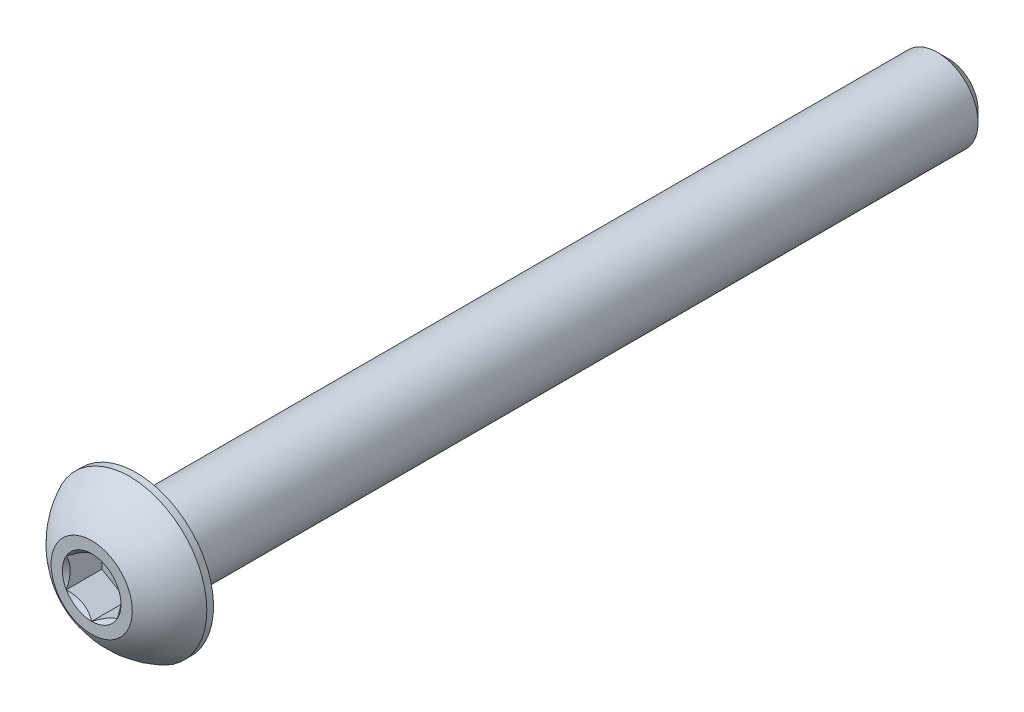
ISO-10303-21;
HEADER;
FILE_DESCRIPTION(('STEP AP214'),'2;1');
FILE_NAME('part.step','',(''),(''),'','','');
FILE_SCHEMA(('AUTOMOTIVE_DESIGN { 1 0 10303 214 1 1 1 1 }'));
ENDSEC;
DATA;
#1=APPLICATION_CONTEXT('core data for automotive mechanical design processes');
#2=APPLICATION_PROTOCOL_DEFINITION('international standard','automotive_design',2000,#1);
#3=PRODUCT_CONTEXT('',#1,'mechanical');
#4=PRODUCT('Part','Part','',(#3));
#5=PRODUCT_RELATED_PRODUCT_CATEGORY('part','',(#4));
#6=PRODUCT_DEFINITION_FORMATION('','',#4);
#7=PRODUCT_DEFINITION_CONTEXT('part definition',#1,'design');
#8=PRODUCT_DEFINITION('design','',#6,#7);
#9=PRODUCT_DEFINITION_SHAPE('','',#8);
#10=(LENGTH_UNIT() NAMED_UNIT(*) SI_UNIT(.MILLI.,.METRE.));
#11=(NAMED_UNIT(*) PLANE_ANGLE_UNIT() SI_UNIT($,.RADIAN.));
#12=(NAMED_UNIT(*) SI_UNIT($,.STERADIAN.) SOLID_ANGLE_UNIT());
#13=UNCERTAINTY_MEASURE_WITH_UNIT(LENGTH_MEASURE(1.E-05),#10,'distance_accuracy_value','');
#14=(GEOMETRIC_REPRESENTATION_CONTEXT(3) GLOBAL_UNCERTAINTY_ASSIGNED_CONTEXT((#13)) GLOBAL_UNIT_ASSIGNED_CONTEXT((#10,
#11,#12)) REPRESENTATION_CONTEXT('',''));
#15=CARTESIAN_POINT('',(0.,0.,0.));
#16=DIRECTION('',(0.,0.,1.));
#17=DIRECTION('',(1.,0.,0.));
#18=AXIS2_PLACEMENT_3D('',#15,#16,#17);
#19=CARTESIAN_POINT('',(0.,0.,21.1));
#20=DIRECTION('',(0.,0.,-1.));
#21=DIRECTION('',(0.,1.,0.));
#22=AXIS2_PLACEMENT_3D('',#19,#20,#21);
#23=PLANE('',#22);
#24=CARTESIAN_POINT('',(0.,0.,21.1));
#25=DIRECTION('',(0.,0.,1.));
#26=DIRECTION('',(1.,0.,0.));
#27=AXIS2_PLACEMENT_3D('',#24,#25,#26);
#28=CIRCLE('',#27,1.44337567297406);
#29=CARTESIAN_POINT('',(0.,1.44337567297406,21.1));
#30=VERTEX_POINT('',#29);
#31=CARTESIAN_POINT('',(-1.25,0.721687836487033,21.1));
#32=VERTEX_POINT('',#31);
#33=EDGE_CURVE('E218',#30,#32,#28,.T.);
#34=ORIENTED_EDGE('',*,*,#33,.F.);
#35=CARTESIAN_POINT('',(1.25,0.721687836487032,21.1));
#36=VERTEX_POINT('',#35);
#37=EDGE_CURVE('E220',#36,#30,#28,.T.);
#38=ORIENTED_EDGE('',*,*,#37,.F.);
#39=CARTESIAN_POINT('',(1.25,-0.721687836487032,21.1));
#40=VERTEX_POINT('',#39);
#41=EDGE_CURVE('E58',#40,#36,#28,.T.);
#42=ORIENTED_EDGE('',*,*,#41,.F.);
#43=CARTESIAN_POINT('',(0.,-1.44337567297406,21.1));
#44=VERTEX_POINT('',#43);
#45=EDGE_CURVE('E65',#44,#40,#28,.T.);
#46=ORIENTED_EDGE('',*,*,#45,.F.);
#47=CARTESIAN_POINT('',(-1.25,-0.721687836487033,21.1));
#48=VERTEX_POINT('',#47);
#49=EDGE_CURVE('E225',#48,#44,#28,.T.);
#50=ORIENTED_EDGE('',*,*,#49,.F.);
#51=EDGE_CURVE('E222',#32,#48,#28,.T.);
#52=ORIENTED_EDGE('',*,*,#51,.F.);
#53=EDGE_LOOP('',(#34,#38,#42,#46,#50,#52));
#54=FACE_BOUND('',#53,.T.);
#55=CARTESIAN_POINT('',(0.,0.,21.1));
#56=DIRECTION('',(0.,0.,1.));
#57=DIRECTION('',(0.,-1.,0.));
#58=AXIS2_PLACEMENT_3D('',#55,#56,#57);
#59=CIRCLE('',#58,1.99999999999999);
#60=CARTESIAN_POINT('',(0.,2.,21.1));
#61=VERTEX_POINT('',#60);
#62=EDGE_CURVE('E52',#61,#61,#59,.T.);
#63=ORIENTED_EDGE('',*,*,#62,.T.);
#64=EDGE_LOOP('',(#63));
#65=FACE_BOUND('',#64,.T.);
#66=ADVANCED_FACE('F39',(#54,#65),#23,.F.);
#67=CARTESIAN_POINT('',(0.,0.,17.3735561497326));
#68=DIRECTION('',(0.,0.,1.));
#69=DIRECTION('',(0.,1.,0.));
#70=AXIS2_PLACEMENT_3D('',#67,#68,#69);
#71=SPHERICAL_SURFACE('',#70,4.22922968981298);
#72=CARTESIAN_POINT('',(0.,0.,19.23));
#73=DIRECTION('',(0.,0.,1.));
#74=DIRECTION('',(0.,-1.,0.));
#75=AXIS2_PLACEMENT_3D('',#72,#73,#74);
#76=CIRCLE('',#75,3.8);
#77=CARTESIAN_POINT('',(0.,3.8,19.23));
#78=VERTEX_POINT('',#77);
#79=EDGE_CURVE('E164',#78,#78,#76,.T.);
#80=CARTESIAN_POINT('',(0.,2.,21.1));
#81=CARTESIAN_POINT('',(0.,2.02421343985614,21.0870045740355));
#82=CARTESIAN_POINT('',(0.,2.04830018323974,21.0737730870349));
#83=CARTESIAN_POINT('',(0.,2.09621120342126,21.0468431584942));
#84=CARTESIAN_POINT('',(0.,2.12003548021917,21.0331447169543));
#85=CARTESIAN_POINT('',(0.,2.16741249358867,21.005286046868));
#86=CARTESIAN_POINT('',(0.,2.19096523016026,20.9911258183216));
#87=CARTESIAN_POINT('',(0.,2.23779021933683,20.962348964764));
#88=CARTESIAN_POINT('',(0.,2.26106247194181,20.9477323397528));
#89=CARTESIAN_POINT('',(0.,2.30731764886072,20.9180482444859));
#90=CARTESIAN_POINT('',(0.,2.33030057317465,20.9029807742302));
#91=CARTESIAN_POINT('',(0.,2.37596836104235,20.8724007144171));
#92=CARTESIAN_POINT('',(0.,2.39865322459612,20.8568881248597));
#93=CARTESIAN_POINT('',(0.,2.44371627121513,20.8254237206041));
#94=CARTESIAN_POINT('',(0.,2.46609445428038,20.8094719059059));
#95=CARTESIAN_POINT('',(0.,2.51053563686181,20.7771351126683));
#96=CARTESIAN_POINT('',(0.,2.53259863637801,20.7607501341289));
#97=CARTESIAN_POINT('',(0.,2.57640106852492,20.7275532390328));
#98=CARTESIAN_POINT('',(0.,2.59814050115564,20.7107413224761));
#99=CARTESIAN_POINT('',(0.,2.64128753915154,20.6766969394119));
#100=CARTESIAN_POINT('',(0.,2.66269514451671,20.6594644729043));
#101=CARTESIAN_POINT('',(0.,2.70517039368395,20.624585537797));
#102=CARTESIAN_POINT('',(0.,2.72623803748602,20.6069390691974));
#103=CARTESIAN_POINT('',(0.,2.76802535840619,20.5712388350756));
#104=CARTESIAN_POINT('',(0.,2.78874503552428,20.5531850695534));
#105=CARTESIAN_POINT('',(0.,2.82982855017313,20.5166771015172));
#106=CARTESIAN_POINT('',(0.,2.85019238770389,20.4982228990032));
#107=CARTESIAN_POINT('',(0.,2.89055648548394,20.460921069069));
#108=CARTESIAN_POINT('',(0.,2.91055674573324,20.4420734416488));
#109=CARTESIAN_POINT('',(0.,2.95018608940553,20.4039919234787));
#110=CARTESIAN_POINT('',(0.,2.96981517282852,20.3847580327288));
#111=CARTESIAN_POINT('',(0.,3.00869470434027,20.3459112962447));
#112=CARTESIAN_POINT('',(0.,3.02794515242903,20.3262984505106));
#113=CARTESIAN_POINT('',(0.,3.06606009863533,20.2867012563963));
#114=CARTESIAN_POINT('',(0.,3.08492459675287,20.2667169080161));
#115=CARTESIAN_POINT('',(0.,3.12226047503003,20.2263843021083));
#116=CARTESIAN_POINT('',(0.,3.14073185518965,20.2060360445808));
#117=CARTESIAN_POINT('',(0.,3.17727447893821,20.1649833521526));
#118=CARTESIAN_POINT('',(0.,3.19534572252716,20.1442789172519));
#119=CARTESIAN_POINT('',(0.,3.23108120656242,20.102521737189));
#120=CARTESIAN_POINT('',(0.,3.24874544700875,20.0814689920269));
#121=CARTESIAN_POINT('',(0.,3.28366021283673,20.039023190901));
#122=CARTESIAN_POINT('',(0.,3.30091073821839,20.0176301349374));
#123=CARTESIAN_POINT('',(0.,3.33499151919534,19.9745118409772));
#124=CARTESIAN_POINT('',(0.,3.35182177479064,19.9527866029806));
#125=CARTESIAN_POINT('',(0.,3.38505562116371,19.9090121999432));
#126=CARTESIAN_POINT('',(0.,3.40145921194149,19.8869630349023));
#127=CARTESIAN_POINT('',(0.,3.43383349577047,19.8425491558485));
#128=CARTESIAN_POINT('',(0.,3.44980418882166,19.8201844418356));
#129=CARTESIAN_POINT('',(0.,3.48130660877275,19.7751479628077));
#130=CARTESIAN_POINT('',(0.,3.49683833567264,19.7524761977926));
#131=CARTESIAN_POINT('',(0.,3.52745692170931,19.7068342314103));
#132=CARTESIAN_POINT('',(0.,3.5425437808461,19.6838640300431));
#133=CARTESIAN_POINT('',(0.,3.57226689871518,19.6376339189693));
#134=CARTESIAN_POINT('',(0.,3.58690315744748,19.6143740092629));
#135=CARTESIAN_POINT('',(0.,3.615719513332,19.5675733197334));
#136=CARTESIAN_POINT('',(0.,3.62989961048422,19.5440325399103));
#137=CARTESIAN_POINT('',(0.,3.65779825442823,19.4966790546141));
#138=CARTESIAN_POINT('',(0.,3.67151680122002,19.4728663491409));
#139=CARTESIAN_POINT('',(0.,3.69848713452321,19.4249780621223));
#140=CARTESIAN_POINT('',(0.,3.71173892103462,19.4009024805769));
#141=CARTESIAN_POINT('',(0.,3.73777068821038,19.3524975842079));
#142=CARTESIAN_POINT('',(0.,3.75055066887474,19.3281682693842));
#143=CARTESIAN_POINT('',(0.,3.77563400658954,19.2792651705548));
#144=CARTESIAN_POINT('',(0.,3.78793736363997,19.254691386549));
#145=CARTESIAN_POINT('',(0.,3.8,19.23));
#146=B_SPLINE_CURVE_WITH_KNOTS('',3,(#80,#81,#82,#83,#84,#85,#86,#87,#88,#89,#90,#91,#92,#93,
#94,#95,#96,#97,#98,#99,#100,#101,#102,#103,#104,#105,#106,#107,#108,#109,#110,#111,#112,#113,
#114,#115,#116,#117,#118,#119,#120,#121,#122,#123,#124,#125,#126,#127,#128,#129,#130,#131,#132,
#133,#134,#135,#136,#137,#138,#139,#140,#141,#142,#143,#144,#145),.UNSPECIFIED.,.F.,.F.,(4,2,2,
2,2,2,2,2,2,2,2,2,2,2,2,2,2,2,2,2,2,2,2,2,2,2,2,2,2,2,2,2,4),(0.,0.0824398589102654,
0.164879717820529,0.247319576730793,0.329759435641059,0.412199294551322,0.494639153461587,
0.577079012371852,0.659518871282116,0.741958730192379,0.824398589102644,0.906838448012908,
0.989278306923173,1.07171816583344,1.1541580247437,1.23659788365396,1.31903774256423,
1.40147760147449,1.48391746038476,1.56635731929502,1.64879717820529,1.73123703711555,
1.81367689602582,1.89611675493608,1.97855661384634,2.06099647275661,2.14343633166687,
2.22587619057714,2.3083160494874,2.39075590839767,2.47319576730793,2.55563562621819,
2.63807548512846),.UNSPECIFIED.);
#147=EDGE_CURVE('BSEAM170',#61,#78,#146,.T.);
#148=ORIENTED_EDGE('',*,*,#62,.F.);
#149=ORIENTED_EDGE('',*,*,#79,.T.);
#150=ORIENTED_EDGE('',*,*,#147,.T.);
#151=ORIENTED_EDGE('',*,*,#147,.F.);
#152=EDGE_LOOP('',(#148,#150,#149,#151));
#153=FACE_BOUND('',#152,.T.);
#154=ADVANCED_FACE('F170',(#153),#71,.T.);
#155=CARTESIAN_POINT('',(0.,0.,21.1));
#156=DIRECTION('',(0.,0.,1.));
#157=DIRECTION('',(0.,-1.,0.));
#158=AXIS2_PLACEMENT_3D('',#155,#156,#157);
#159=CYLINDRICAL_SURFACE('',#158,3.8);
#160=ORIENTED_EDGE('',*,*,#79,.F.);
#161=EDGE_LOOP('',(#160));
#162=FACE_BOUND('',#161,.T.);
#163=CARTESIAN_POINT('',(0.,0.,18.9));
#164=DIRECTION('',(0.,0.,1.));
#165=DIRECTION('',(0.,-1.,0.));
#166=AXIS2_PLACEMENT_3D('',#163,#164,#165);
#167=CIRCLE('',#166,3.8);
#168=CARTESIAN_POINT('',(0.,-3.79999999999999,18.9));
#169=VERTEX_POINT('',#168);
#170=EDGE_CURVE('E161',#169,#169,#167,.T.);
#171=ORIENTED_EDGE('',*,*,#170,.T.);
#172=EDGE_LOOP('',(#171));
#173=FACE_BOUND('',#172,.T.);
#174=ADVANCED_FACE('F173',(#162,#173),#159,.T.);
#175=CARTESIAN_POINT('',(0.,1.99999999999999,18.9));
#176=DIRECTION('',(0.,0.,1.));
#177=DIRECTION('',(0.,-1.,0.));
#178=AXIS2_PLACEMENT_3D('',#175,#176,#177);
#179=PLANE('',#178);
#180=ORIENTED_EDGE('',*,*,#170,.F.);
#181=EDGE_LOOP('',(#180));
#182=FACE_BOUND('',#181,.T.);
#183=CARTESIAN_POINT('',(0.,0.,18.9));
#184=DIRECTION('',(0.,0.,1.));
#185=DIRECTION('',(0.,-1.,0.));
#186=AXIS2_PLACEMENT_3D('',#183,#184,#185);
#187=CIRCLE('',#186,1.99999999999999);
#188=CARTESIAN_POINT('',(0.,-1.99999999999998,18.9));
#189=VERTEX_POINT('',#188);
#190=EDGE_CURVE('E158',#189,#189,#187,.T.);
#191=ORIENTED_EDGE('',*,*,#190,.T.);
#192=EDGE_LOOP('',(#191));
#193=FACE_BOUND('',#192,.T.);
#194=ADVANCED_FACE('F178',(#182,#193),#179,.F.);
#195=CARTESIAN_POINT('',(0.,0.,21.1));
#196=DIRECTION('',(0.,0.,1.));
#197=DIRECTION('',(0.,-1.,0.));
#198=AXIS2_PLACEMENT_3D('',#195,#196,#197);
#199=CYLINDRICAL_SURFACE('',#198,1.99999999999999);
#200=ORIENTED_EDGE('',*,*,#190,.F.);
#201=EDGE_LOOP('',(#200));
#202=FACE_BOUND('',#201,.T.);
#203=CARTESIAN_POINT('',(0.,0.,-20.54));
#204=DIRECTION('',(0.,0.,1.));
#205=DIRECTION('',(0.,-1.,0.));
#206=AXIS2_PLACEMENT_3D('',#203,#204,#205);
#207=CIRCLE('',#206,1.99999999999999);
#208=CARTESIAN_POINT('',(0.,-1.99999999999999,-20.54));
#209=VERTEX_POINT('',#208);
#210=EDGE_CURVE('E155',#209,#209,#207,.T.);
#211=ORIENTED_EDGE('',*,*,#210,.T.);
#212=EDGE_LOOP('',(#211));
#213=FACE_BOUND('',#212,.T.);
#214=ADVANCED_FACE('F184',(#202,#213),#199,.T.);
#215=CARTESIAN_POINT('',(0.,0.,-21.1));
#216=DIRECTION('',(0.,0.,1.));
#217=DIRECTION('',(0.,-1.,0.));
#218=AXIS2_PLACEMENT_3D('',#215,#216,#217);
#219=CONICAL_SURFACE('',#218,1.44,0.785398163397441);
#220=ORIENTED_EDGE('',*,*,#210,.F.);
#221=EDGE_LOOP('',(#220));
#222=FACE_BOUND('',#221,.T.);
#223=CARTESIAN_POINT('',(0.,0.,-21.1));
#224=DIRECTION('',(0.,0.,1.));
#225=DIRECTION('',(0.,-1.,0.));
#226=AXIS2_PLACEMENT_3D('',#223,#224,#225);
#227=CIRCLE('',#226,1.44);
#228=CARTESIAN_POINT('',(0.,-1.43999999999999,-21.1));
#229=VERTEX_POINT('',#228);
#230=EDGE_CURVE('E142',#229,#229,#227,.T.);
#231=ORIENTED_EDGE('',*,*,#230,.T.);
#232=EDGE_LOOP('',(#231));
#233=FACE_BOUND('',#232,.T.);
#234=ADVANCED_FACE('F190',(#222,#233),#219,.T.);
#235=CARTESIAN_POINT('',(0.,0.,-21.1));
#236=DIRECTION('',(0.,0.,1.));
#237=DIRECTION('',(0.,-1.,0.));
#238=AXIS2_PLACEMENT_3D('',#235,#236,#237);
#239=PLANE('',#238);
#240=ORIENTED_EDGE('',*,*,#230,.F.);
#241=EDGE_LOOP('',(#240));
#242=FACE_BOUND('',#241,.T.);
#243=ADVANCED_FACE('F196',(#242),#239,.F.);
#244=CARTESIAN_POINT('',(0.,0.,21.1));
#245=DIRECTION('',(0.,0.,1.));
#246=DIRECTION('',(1.,0.,0.));
#247=AXIS2_PLACEMENT_3D('',#244,#245,#246);
#248=CONICAL_SURFACE('',#247,1.44337567297406,0.78539816339745);
#249=ORIENTED_EDGE('',*,*,#33,.T.);
#250=CARTESIAN_POINT('',(0.000200000000000288,1.4434911430279,21.1001154839091));
#251=CARTESIAN_POINT('',(-0.0427751670715862,1.41867941875065,21.0753216680551));
#252=CARTESIAN_POINT('',(-0.0864690047459469,1.39345276980743,21.0519837344187));
#253=CARTESIAN_POINT('',(-0.17556593084194,1.34201263554194,21.0092520040845));
#254=CARTESIAN_POINT('',(-0.220977498357061,1.31579425481277,20.9898819923604));
#255=CARTESIAN_POINT('',(-0.312547820935257,1.26292610442246,20.9567004834135));
#256=CARTESIAN_POINT('',(-0.358683240175883,1.23628980770471,20.9428055590527));
#257=CARTESIAN_POINT('',(-0.451970080407589,1.18243062538509,20.9213972821606));
#258=CARTESIAN_POINT('',(-0.499118649136376,1.15520938653762,20.9138679415668));
#259=CARTESIAN_POINT('',(-0.580373556887248,1.10829684367467,20.9070744980507));
#260=CARTESIAN_POINT('',(-0.614374876627936,1.08866617256958,20.9060685591044));
#261=CARTESIAN_POINT('',(-0.682317764432473,1.04943932800611,20.9077614149113));
#262=CARTESIAN_POINT('',(-0.716259317655653,1.029843163116,20.9104610272155));
#263=CARTESIAN_POINT('',(-0.783814856457495,0.990839954603502,20.9194089303164));
#264=CARTESIAN_POINT('',(-0.81742850728677,0.971433104248774,20.9256605258997));
#265=CARTESIAN_POINT('',(-0.884094638217808,0.932943395609908,20.9413756814139));
#266=CARTESIAN_POINT('',(-0.917146871030291,0.913860680098303,20.9508406200875));
#267=CARTESIAN_POINT('',(-1.00179969160026,0.86498635135457,20.9789313906876));
#268=CARTESIAN_POINT('',(-1.05286649242964,0.835502920149078,20.9996701574522));
#269=CARTESIAN_POINT('',(-1.15300085411325,0.77769031947591,21.0463871346715));
#270=CARTESIAN_POINT('',(-1.20207431157827,0.749357745598417,21.0723482959468));
#271=CARTESIAN_POINT('',(-1.2502,0.721572366433195,21.1001154839091));
#272=B_SPLINE_CURVE_WITH_KNOTS('',3,(#250,#251,#252,#253,#254,#255,#256,#257,#258,#259,#260,
#261,#262,#263,#264,#265,#266,#267,#268,#269,#270,#271),.UNSPECIFIED.,.F.,.F.,(4,2,2,2,2,2,2,2,
2,2,4),(0.,0.166533409618302,0.334037607289759,0.498880396489694,0.66330791924027,
0.780963963458822,0.898645970148448,1.01643764860773,1.13427993171549,1.32148652032141,
1.50809158792574),.UNSPECIFIED.);
#273=EDGE_CURVE('E11',#30,#32,#272,.T.);
#274=ORIENTED_EDGE('',*,*,#273,.F.);
#275=EDGE_LOOP('',(#249,#274));
#276=FACE_BOUND('',#275,.T.);
#277=ADVANCED_FACE('F201',(#276),#248,.F.);
#278=ORIENTED_EDGE('',*,*,#51,.T.);
#279=CARTESIAN_POINT('',(-1.25,-1.43934010808077,21.5629820968923));
#280=CARTESIAN_POINT('',(-1.25,-1.40429313005658,21.5365249226329));
#281=CARTESIAN_POINT('',(-1.25,-1.36905087135599,21.5103271603543));
#282=CARTESIAN_POINT('',(-1.25,-1.29809650706311,21.4585575718396));
#283=CARTESIAN_POINT('',(-1.25,-1.26238428576495,21.4329859043563));
#284=CARTESIAN_POINT('',(-1.25,-1.15390111792708,21.3570059936895));
#285=CARTESIAN_POINT('',(-1.25,-1.08031646726264,21.3077402861896));
#286=CARTESIAN_POINT('',(-1.25,-0.926012322755094,21.2110258302631));
#287=CARTESIAN_POINT('',(-1.25,-0.845125318656145,21.1638412989418));
#288=CARTESIAN_POINT('',(-1.25,-0.679311174076601,21.0775307343904));
#289=CARTESIAN_POINT('',(-1.25,-0.594398891026687,21.0383775346269));
#290=CARTESIAN_POINT('',(-1.25,-0.466944812460739,20.9904772236883));
#291=CARTESIAN_POINT('',(-1.25,-0.42628998581282,20.9767294897863));
#292=CARTESIAN_POINT('',(-1.25,-0.343998850091266,20.9524979274505));
#293=CARTESIAN_POINT('',(-1.25,-0.302362473614961,20.9420143238698));
#294=CARTESIAN_POINT('',(-1.25,-0.219052696285664,20.9250301617483));
#295=CARTESIAN_POINT('',(-1.25,-0.177393428474499,20.9184613604714));
#296=CARTESIAN_POINT('',(-1.25,-0.0936293693401909,20.9094350534578));
#297=CARTESIAN_POINT('',(-1.25,-0.0515246558543948,20.9069768409973));
#298=CARTESIAN_POINT('',(-1.25,0.0311890576306328,20.9063540620133));
#299=CARTESIAN_POINT('',(-1.25,0.0717969625499318,20.9080371168462));
#300=CARTESIAN_POINT('',(-1.25,0.152668636885199,20.9152682705979));
#301=CARTESIAN_POINT('',(-1.25,0.19293233883536,20.9208171104131));
#302=CARTESIAN_POINT('',(-1.25,0.273499879165297,20.935571036465));
#303=CARTESIAN_POINT('',(-1.25,0.313792180618513,20.9448381759641));
#304=CARTESIAN_POINT('',(-1.25,0.393496413911459,20.9665361784573));
#305=CARTESIAN_POINT('',(-1.25,0.432908419115061,20.9789667767306));
#306=CARTESIAN_POINT('',(-1.25,0.5569927358623,21.0227793529314));
#307=CARTESIAN_POINT('',(-1.25,0.639898924666088,21.059151072876));
#308=CARTESIAN_POINT('',(-1.25,0.801816555499705,21.1400191621783));
#309=CARTESIAN_POINT('',(-1.25,0.880812666325048,21.184544720912));
#310=CARTESIAN_POINT('',(-1.25,1.0317856127975,21.2764048766666));
#311=CARTESIAN_POINT('',(-1.25,1.10391618485086,21.3234899339162));
#312=CARTESIAN_POINT('',(-1.25,1.21018606043311,21.3962785615985));
#313=CARTESIAN_POINT('',(-1.25,1.2451506996938,21.4207980853934));
#314=CARTESIAN_POINT('',(-1.25,1.31460220852737,21.4704856367657));
#315=CARTESIAN_POINT('',(-1.25,1.34908920596618,21.4956534854155));
#316=CARTESIAN_POINT('',(-1.25,1.38337731682912,21.5210901488412));
#317=B_SPLINE_CURVE_WITH_KNOTS('',3,(#279,#280,#281,#282,#283,#284,#285,#286,#287,#288,#289,
#290,#291,#292,#293,#294,#295,#296,#297,#298,#299,#300,#301,#302,#303,#304,#305,#306,#307,#308,
#309,#310,#311,#312,#313,#314,#315,#316),.UNSPECIFIED.,.F.,.F.,(4,2,2,2,2,2,2,2,2,2,2,2,2,2,2,2,
2,2,4),(0.,0.131732960381448,0.263498984161645,0.529042014455824,0.809741926134618,
1.08947609717225,1.21811634272577,1.346765447839,1.47310084517844,1.59941451973784,
1.72115042167849,1.84290966131735,1.96679153905342,2.09066305366039,2.36146692896009,
2.63325989198491,2.89154668212279,3.01965734507713,3.14773302245628),.UNSPECIFIED.);
#318=EDGE_CURVE('E224',#32,#48,#317,.F.);
#319=ORIENTED_EDGE('',*,*,#318,.F.);
#320=EDGE_LOOP('',(#278,#319));
#321=FACE_BOUND('',#320,.T.);
#322=ADVANCED_FACE('F207',(#321),#248,.F.);
#323=ORIENTED_EDGE('',*,*,#49,.T.);
#324=CARTESIAN_POINT('',(-1.2502,-0.721572366433194,21.1001154839091));
#325=CARTESIAN_POINT('',(-1.20722483292841,-0.746384090710444,21.0753216680551));
#326=CARTESIAN_POINT('',(-1.16353099525405,-0.771610739653664,21.0519837344187));
#327=CARTESIAN_POINT('',(-1.07443406915806,-0.823050873919153,21.0092520040845));
#328=CARTESIAN_POINT('',(-1.02902250164294,-0.849269254648332,20.9898819923604));
#329=CARTESIAN_POINT('',(-0.937452179064742,-0.902137405038634,20.9567004834135));
#330=CARTESIAN_POINT('',(-0.891316759824117,-0.928773701756386,20.9428055590527));
#331=CARTESIAN_POINT('',(-0.79802991959241,-0.982632884076011,20.9213972821606));
#332=CARTESIAN_POINT('',(-0.750881350863623,-1.00985412292348,20.9138679415668));
#333=CARTESIAN_POINT('',(-0.66962644311275,-1.05676666578643,20.9070744980507));
#334=CARTESIAN_POINT('',(-0.635625123372062,-1.07639733689152,20.9060685591044));
#335=CARTESIAN_POINT('',(-0.567682235567525,-1.11562418145499,20.9077614149113));
#336=CARTESIAN_POINT('',(-0.533740682344345,-1.1352203463451,20.9104610272155));
#337=CARTESIAN_POINT('',(-0.466185143542503,-1.1742235548576,20.9194089303164));
#338=CARTESIAN_POINT('',(-0.432571492713228,-1.19363040521232,20.9256605258997));
#339=CARTESIAN_POINT('',(-0.36590536178219,-1.23212011385119,20.9413756814139));
#340=CARTESIAN_POINT('',(-0.332853128969707,-1.25120282936279,20.9508406200875));
#341=CARTESIAN_POINT('',(-0.248200308399738,-1.30007715810653,20.9789313906876));
#342=CARTESIAN_POINT('',(-0.197133507570364,-1.32956058931202,20.9996701574522));
#343=CARTESIAN_POINT('',(-0.0969991458867463,-1.38737318998519,21.0463871346715));
#344=CARTESIAN_POINT('',(-0.0479256884217311,-1.41570576386268,21.0723482959468));
#345=CARTESIAN_POINT('',(0.000200000000000502,-1.4434911430279,21.1001154839091));
#346=B_SPLINE_CURVE_WITH_KNOTS('',3,(#324,#325,#326,#327,#328,#329,#330,#331,#332,#333,#334,
#335,#336,#337,#338,#339,#340,#341,#342,#343,#344,#345),.UNSPECIFIED.,.F.,.F.,(4,2,2,2,2,2,2,2,
2,2,4),(0.,0.166533409618302,0.33403760728976,0.498880396489696,0.663307919240272,
0.780963963458824,0.89864597014845,1.01643764860773,1.13427993171549,1.32148652032141,
1.50809158792574),.UNSPECIFIED.);
#347=EDGE_CURVE('E234',#48,#44,#346,.T.);
#348=ORIENTED_EDGE('',*,*,#347,.F.);
#349=EDGE_LOOP('',(#323,#348));
#350=FACE_BOUND('',#349,.T.);
#351=ADVANCED_FACE('F284',(#350),#248,.F.);
#352=ORIENTED_EDGE('',*,*,#45,.T.);
#353=CARTESIAN_POINT('',(-0.000200000000000873,-1.4434911430279,21.1001154839091));
#354=CARTESIAN_POINT('',(0.0427751670715854,-1.41867941875065,21.0753216680551));
#355=CARTESIAN_POINT('',(0.0864690047459462,-1.39345276980743,21.0519837344187));
#356=CARTESIAN_POINT('',(0.175565930841939,-1.34201263554194,21.0092520040845));
#357=CARTESIAN_POINT('',(0.220977498357061,-1.31579425481276,20.9898819923604));
#358=CARTESIAN_POINT('',(0.312547820935256,-1.26292610442246,20.9567004834135));
#359=CARTESIAN_POINT('',(0.358683240175882,-1.23628980770471,20.9428055590527));
#360=CARTESIAN_POINT('',(0.451970080407588,-1.18243062538509,20.9213972821606));
#361=CARTESIAN_POINT('',(0.499118649136376,-1.15520938653761,20.9138679415668));
#362=CARTESIAN_POINT('',(0.580373556887249,-1.10829684367467,20.9070744980507));
#363=CARTESIAN_POINT('',(0.614374876627938,-1.08866617256958,20.9060685591043));
#364=CARTESIAN_POINT('',(0.682317764432474,-1.04943932800611,20.9077614149113));
#365=CARTESIAN_POINT('',(0.716259317655654,-1.02984316311599,20.9104610272155));
#366=CARTESIAN_POINT('',(0.783814856457496,-0.990839954603501,20.9194089303164));
#367=CARTESIAN_POINT('',(0.817428507286771,-0.971433104248773,20.9256605258997));
#368=CARTESIAN_POINT('',(0.88409463821781,-0.932943395609907,20.9413756814139));
#369=CARTESIAN_POINT('',(0.917146871030292,-0.913860680098302,20.9508406200875));
#370=CARTESIAN_POINT('',(1.00179969160026,-0.864986351354569,20.9789313906876));
#371=CARTESIAN_POINT('',(1.05286649242964,-0.835502920149077,20.9996701574522));
#372=CARTESIAN_POINT('',(1.15300085411325,-0.777690319475909,21.0463871346715));
#373=CARTESIAN_POINT('',(1.20207431157827,-0.749357745598416,21.0723482959468));
#374=CARTESIAN_POINT('',(1.2502,-0.721572366433194,21.1001154839091));
#375=B_SPLINE_CURVE_WITH_KNOTS('',3,(#353,#354,#355,#356,#357,#358,#359,#360,#361,#362,#363,
#364,#365,#366,#367,#368,#369,#370,#371,#372,#373,#374),.UNSPECIFIED.,.F.,.F.,(4,2,2,2,2,2,2,2,
2,2,4),(0.,0.166533409618302,0.33403760728976,0.498880396489695,0.663307919240272,
0.780963963458824,0.898645970148451,1.01643764860773,1.13427993171549,1.32148652032141,
1.50809158792574),.UNSPECIFIED.);
#376=EDGE_CURVE('E272',#44,#40,#375,.T.);
#377=ORIENTED_EDGE('',*,*,#376,.F.);
#378=EDGE_LOOP('',(#352,#377));
#379=FACE_BOUND('',#378,.T.);
#380=ADVANCED_FACE('F285',(#379),#248,.F.);
#381=ORIENTED_EDGE('',*,*,#41,.T.);
#382=CARTESIAN_POINT('',(1.25,-1.43934010808077,21.5629820968923));
#383=CARTESIAN_POINT('',(1.25,-1.40429313005658,21.5365249226329));
#384=CARTESIAN_POINT('',(1.25,-1.36905087135599,21.5103271603543));
#385=CARTESIAN_POINT('',(1.25,-1.29809650706311,21.4585575718396));
#386=CARTESIAN_POINT('',(1.25,-1.26238428576495,21.4329859043563));
#387=CARTESIAN_POINT('',(1.25,-1.15390111792708,21.3570059936895));
#388=CARTESIAN_POINT('',(1.25,-1.08031646726264,21.3077402861896));
#389=CARTESIAN_POINT('',(1.25,-0.926012322755094,21.2110258302631));
#390=CARTESIAN_POINT('',(1.25,-0.845125318656146,21.1638412989418));
#391=CARTESIAN_POINT('',(1.25,-0.679311174076601,21.0775307343904));
#392=CARTESIAN_POINT('',(1.25,-0.594398891026686,21.0383775346269));
#393=CARTESIAN_POINT('',(1.25,-0.466944812460738,20.9904772236883));
#394=CARTESIAN_POINT('',(1.25,-0.426289985812819,20.9767294897863));
#395=CARTESIAN_POINT('',(1.25,-0.343998850091265,20.9524979274505));
#396=CARTESIAN_POINT('',(1.25,-0.302362473614961,20.9420143238698));
#397=CARTESIAN_POINT('',(1.25,-0.219052696285664,20.9250301617483));
#398=CARTESIAN_POINT('',(1.25,-0.177393428474498,20.9184613604714));
#399=CARTESIAN_POINT('',(1.25,-0.0936293693401907,20.9094350534578));
#400=CARTESIAN_POINT('',(1.25,-0.0515246558543946,20.9069768409973));
#401=CARTESIAN_POINT('',(1.25,0.0311890576306331,20.9063540620133));
#402=CARTESIAN_POINT('',(1.25,0.0717969625499321,20.9080371168462));
#403=CARTESIAN_POINT('',(1.25,0.152668636885199,20.9152682705979));
#404=CARTESIAN_POINT('',(1.25,0.19293233883536,20.9208171104131));
#405=CARTESIAN_POINT('',(1.25,0.273499879165297,20.935571036465));
#406=CARTESIAN_POINT('',(1.25,0.313792180618513,20.9448381759641));
#407=CARTESIAN_POINT('',(1.25,0.393496413911459,20.9665361784573));
#408=CARTESIAN_POINT('',(1.25,0.432908419115061,20.9789667767306));
#409=CARTESIAN_POINT('',(1.25,0.5569927358623,21.0227793529314));
#410=CARTESIAN_POINT('',(1.25,0.639898924666088,21.059151072876));
#411=CARTESIAN_POINT('',(1.25,0.801816555499704,21.1400191621783));
#412=CARTESIAN_POINT('',(1.25,0.880812666325047,21.184544720912));
#413=CARTESIAN_POINT('',(1.25,1.0317856127975,21.2764048766666));
#414=CARTESIAN_POINT('',(1.25,1.10391618485086,21.3234899339162));
#415=CARTESIAN_POINT('',(1.25,1.21018606043311,21.3962785615985));
#416=CARTESIAN_POINT('',(1.25,1.2451506996938,21.4207980853934));
#417=CARTESIAN_POINT('',(1.25,1.31460220852737,21.4704856367657));
#418=CARTESIAN_POINT('',(1.25,1.34908920596618,21.4956534854155));
#419=CARTESIAN_POINT('',(1.25,1.38337731682912,21.5210901488412));
#420=B_SPLINE_CURVE_WITH_KNOTS('',3,(#382,#383,#384,#385,#386,#387,#388,#389,#390,#391,#392,
#393,#394,#395,#396,#397,#398,#399,#400,#401,#402,#403,#404,#405,#406,#407,#408,#409,#410,#411,
#412,#413,#414,#415,#416,#417,#418,#419),.UNSPECIFIED.,.F.,.F.,(4,2,2,2,2,2,2,2,2,2,2,2,2,2,2,2,
2,2,4),(0.,0.131732960381447,0.263498984161644,0.529042014455823,0.809741926134617,
1.08947609717225,1.21811634272577,1.346765447839,1.47310084517844,1.59941451973784,
1.72115042167849,1.84290966131735,1.96679153905342,2.09066305366039,2.36146692896009,
2.63325989198491,2.89154668212279,3.01965734507713,3.14773302245628),.UNSPECIFIED.);
#421=EDGE_CURVE('E124',#40,#36,#420,.T.);
#422=ORIENTED_EDGE('',*,*,#421,.F.);
#423=EDGE_LOOP('',(#381,#422));
#424=FACE_BOUND('',#423,.T.);
#425=ADVANCED_FACE('F287',(#424),#248,.F.);
#426=ORIENTED_EDGE('',*,*,#37,.T.);
#427=CARTESIAN_POINT('',(1.2502,0.721572366433194,21.1001154839091));
#428=CARTESIAN_POINT('',(1.20722483292841,0.746384090710444,21.0753216680551));
#429=CARTESIAN_POINT('',(1.16353099525405,0.771610739653664,21.0519837344187));
#430=CARTESIAN_POINT('',(1.07443406915806,0.823050873919153,21.0092520040845));
#431=CARTESIAN_POINT('',(1.02902250164294,0.849269254648332,20.9898819923604));
#432=CARTESIAN_POINT('',(0.937452179064743,0.902137405038634,20.9567004834135));
#433=CARTESIAN_POINT('',(0.891316759824118,0.928773701756385,20.9428055590527));
#434=CARTESIAN_POINT('',(0.798029919592411,0.982632884076011,20.9213972821606));
#435=CARTESIAN_POINT('',(0.750881350863624,1.00985412292348,20.9138679415668));
#436=CARTESIAN_POINT('',(0.669626443112751,1.05676666578643,20.9070744980507));
#437=CARTESIAN_POINT('',(0.635625123372062,1.07639733689152,20.9060685591043));
#438=CARTESIAN_POINT('',(0.567682235567526,1.11562418145499,20.9077614149113));
#439=CARTESIAN_POINT('',(0.533740682344346,1.1352203463451,20.9104610272155));
#440=CARTESIAN_POINT('',(0.466185143542504,1.1742235548576,20.9194089303164));
#441=CARTESIAN_POINT('',(0.432571492713228,1.19363040521232,20.9256605258997));
#442=CARTESIAN_POINT('',(0.36590536178219,1.23212011385119,20.9413756814139));
#443=CARTESIAN_POINT('',(0.332853128969707,1.25120282936279,20.9508406200875));
#444=CARTESIAN_POINT('',(0.248200308399738,1.30007715810653,20.9789313906876));
#445=CARTESIAN_POINT('',(0.197133507570364,1.32956058931202,20.9996701574522));
#446=CARTESIAN_POINT('',(0.0969991458867462,1.38737318998519,21.0463871346715));
#447=CARTESIAN_POINT('',(0.0479256884217309,1.41570576386268,21.0723482959468));
#448=CARTESIAN_POINT('',(-0.00020000000000079,1.4434911430279,21.1001154839091));
#449=B_SPLINE_CURVE_WITH_KNOTS('',3,(#427,#428,#429,#430,#431,#432,#433,#434,#435,#436,#437,
#438,#439,#440,#441,#442,#443,#444,#445,#446,#447,#448),.UNSPECIFIED.,.F.,.F.,(4,2,2,2,2,2,2,2,
2,2,4),(0.,0.166533409618302,0.33403760728976,0.498880396489694,0.663307919240272,
0.780963963458824,0.89864597014845,1.01643764860773,1.13427993171549,1.32148652032141,
1.50809158792574),.UNSPECIFIED.);
#450=EDGE_CURVE('E105',#36,#30,#449,.T.);
#451=ORIENTED_EDGE('',*,*,#450,.F.);
#452=EDGE_LOOP('',(#426,#451));
#453=FACE_BOUND('',#452,.T.);
#454=ADVANCED_FACE('F209',(#453),#248,.F.);
#455=CARTESIAN_POINT('',(0.,0.,19.35));
#456=DIRECTION('',(0.,0.,1.));
#457=DIRECTION('',(1.,0.,0.));
#458=AXIS2_PLACEMENT_3D('',#455,#456,#457);
#459=PLANE('',#458);
#460=DIRECTION('',(-0.866025403784439,0.5,0.));
#461=VECTOR('',#460,1.);
#462=CARTESIAN_POINT('',(1.25,0.721687836487032,19.35));
#463=LINE('',#462,#461);
#464=CARTESIAN_POINT('',(1.25,0.721687836487032,19.35));
#465=VERTEX_POINT('',#464);
#466=CARTESIAN_POINT('',(0.,1.44337567297406,19.35));
#467=VERTEX_POINT('',#466);
#468=EDGE_CURVE('E103',#465,#467,#463,.T.);
#469=ORIENTED_EDGE('',*,*,#468,.T.);
#470=DIRECTION('',(-0.866025403784439,-0.5,0.));
#471=VECTOR('',#470,1.);
#472=CARTESIAN_POINT('',(0.,1.44337567297406,19.35));
#473=LINE('',#472,#471);
#474=CARTESIAN_POINT('',(-1.25,0.721687836487033,19.35));
#475=VERTEX_POINT('',#474);
#476=EDGE_CURVE('E112',#467,#475,#473,.T.);
#477=ORIENTED_EDGE('',*,*,#476,.T.);
#478=DIRECTION('',(0.,-1.,0.));
#479=VECTOR('',#478,1.);
#480=CARTESIAN_POINT('',(-1.25,0.721687836487033,19.35));
#481=LINE('',#480,#479);
#482=CARTESIAN_POINT('',(-1.25,-0.721687836487032,19.35));
#483=VERTEX_POINT('',#482);
#484=EDGE_CURVE('E118',#475,#483,#481,.T.);
#485=ORIENTED_EDGE('',*,*,#484,.T.);
#486=DIRECTION('',(0.866025403784439,-0.5,0.));
#487=VECTOR('',#486,1.);
#488=CARTESIAN_POINT('',(-1.25,-0.721687836487032,19.35));
#489=LINE('',#488,#487);
#490=CARTESIAN_POINT('',(0.,-1.44337567297406,19.35));
#491=VERTEX_POINT('',#490);
#492=EDGE_CURVE('E134',#483,#491,#489,.T.);
#493=ORIENTED_EDGE('',*,*,#492,.T.);
#494=DIRECTION('',(0.866025403784439,0.5,0.));
#495=VECTOR('',#494,1.);
#496=CARTESIAN_POINT('',(0.,-1.44337567297406,19.35));
#497=LINE('',#496,#495);
#498=CARTESIAN_POINT('',(1.25,-0.721687836487032,19.35));
#499=VERTEX_POINT('',#498);
#500=EDGE_CURVE('E137',#491,#499,#497,.T.);
#501=ORIENTED_EDGE('',*,*,#500,.T.);
#502=DIRECTION('',(0.,1.,0.));
#503=VECTOR('',#502,1.);
#504=CARTESIAN_POINT('',(1.25,-0.721687836487032,19.35));
#505=LINE('',#504,#503);
#506=EDGE_CURVE('E109',#499,#465,#505,.T.);
#507=ORIENTED_EDGE('',*,*,#506,.T.);
#508=EDGE_LOOP('',(#469,#477,#485,#493,#501,#507));
#509=FACE_BOUND('',#508,.T.);
#510=ADVANCED_FACE('F120',(#509),#459,.T.);
#511=CARTESIAN_POINT('',(0.,1.44337567297406,19.35));
#512=DIRECTION('',(-0.5,0.866025403784439,0.));
#513=DIRECTION('',(-0.866025403784439,-0.5,0.));
#514=AXIS2_PLACEMENT_3D('',#511,#512,#513);
#515=PLANE('',#514);
#516=DIRECTION('',(0.,0.,1.));
#517=VECTOR('',#516,1.);
#518=CARTESIAN_POINT('',(0.,1.44337567297406,19.35));
#519=LINE('',#518,#517);
#520=EDGE_CURVE('E98',#467,#30,#519,.T.);
#521=ORIENTED_EDGE('',*,*,#520,.T.);
#522=ORIENTED_EDGE('',*,*,#273,.T.);
#523=DIRECTION('',(0.,0.,1.));
#524=VECTOR('',#523,1.);
#525=CARTESIAN_POINT('',(-1.25,0.721687836487033,19.35));
#526=LINE('',#525,#524);
#527=EDGE_CURVE('E108',#475,#32,#526,.T.);
#528=ORIENTED_EDGE('',*,*,#527,.F.);
#529=ORIENTED_EDGE('',*,*,#476,.F.);
#530=EDGE_LOOP('',(#521,#522,#528,#529));
#531=FACE_BOUND('',#530,.T.);
#532=ADVANCED_FACE('F113',(#531),#515,.F.);
#533=CARTESIAN_POINT('',(-1.25,0.721687836487033,19.35));
#534=DIRECTION('',(-1.,0.,0.));
#535=DIRECTION('',(0.,0.,1.));
#536=AXIS2_PLACEMENT_3D('',#533,#534,#535);
#537=PLANE('',#536);
#538=ORIENTED_EDGE('',*,*,#527,.T.);
#539=ORIENTED_EDGE('',*,*,#318,.T.);
#540=DIRECTION('',(0.,0.,1.));
#541=VECTOR('',#540,1.);
#542=CARTESIAN_POINT('',(-1.25,-0.721687836487032,19.35));
#543=LINE('',#542,#541);
#544=EDGE_CURVE('E149',#483,#48,#543,.T.);
#545=ORIENTED_EDGE('',*,*,#544,.F.);
#546=ORIENTED_EDGE('',*,*,#484,.F.);
#547=EDGE_LOOP('',(#538,#539,#545,#546));
#548=FACE_BOUND('',#547,.T.);
#549=ADVANCED_FACE('F243',(#548),#537,.F.);
#550=CARTESIAN_POINT('',(-1.25,-0.721687836487032,19.35));
#551=DIRECTION('',(-0.5,-0.866025403784438,0.));
#552=DIRECTION('',(0.866025403784439,-0.5,0.));
#553=AXIS2_PLACEMENT_3D('',#550,#551,#552);
#554=PLANE('',#553);
#555=ORIENTED_EDGE('',*,*,#544,.T.);
#556=ORIENTED_EDGE('',*,*,#347,.T.);
#557=DIRECTION('',(0.,0.,1.));
#558=VECTOR('',#557,1.);
#559=CARTESIAN_POINT('',(0.,-1.44337567297406,19.35));
#560=LINE('',#559,#558);
#561=EDGE_CURVE('E146',#491,#44,#560,.T.);
#562=ORIENTED_EDGE('',*,*,#561,.F.);
#563=ORIENTED_EDGE('',*,*,#492,.F.);
#564=EDGE_LOOP('',(#555,#556,#562,#563));
#565=FACE_BOUND('',#564,.T.);
#566=ADVANCED_FACE('F246',(#565),#554,.F.);
#567=CARTESIAN_POINT('',(0.,-1.44337567297406,19.35));
#568=DIRECTION('',(0.5,-0.866025403784439,0.));
#569=DIRECTION('',(0.866025403784439,0.5,0.));
#570=AXIS2_PLACEMENT_3D('',#567,#568,#569);
#571=PLANE('',#570);
#572=ORIENTED_EDGE('',*,*,#561,.T.);
#573=ORIENTED_EDGE('',*,*,#376,.T.);
#574=DIRECTION('',(0.,0.,1.));
#575=VECTOR('',#574,1.);
#576=CARTESIAN_POINT('',(1.25,-0.721687836487032,19.35));
#577=LINE('',#576,#575);
#578=EDGE_CURVE('E143',#499,#40,#577,.T.);
#579=ORIENTED_EDGE('',*,*,#578,.F.);
#580=ORIENTED_EDGE('',*,*,#500,.F.);
#581=EDGE_LOOP('',(#572,#573,#579,#580));
#582=FACE_BOUND('',#581,.T.);
#583=ADVANCED_FACE('F258',(#582),#571,.F.);
#584=CARTESIAN_POINT('',(1.25,-0.721687836487032,19.35));
#585=DIRECTION('',(1.,0.,0.));
#586=DIRECTION('',(0.,1.,0.));
#587=AXIS2_PLACEMENT_3D('',#584,#585,#586);
#588=PLANE('',#587);
#589=ORIENTED_EDGE('',*,*,#578,.T.);
#590=ORIENTED_EDGE('',*,*,#421,.T.);
#591=DIRECTION('',(0.,0.,1.));
#592=VECTOR('',#591,1.);
#593=CARTESIAN_POINT('',(1.25,0.721687836487032,19.35));
#594=LINE('',#593,#592);
#595=EDGE_CURVE('E140',#465,#36,#594,.T.);
#596=ORIENTED_EDGE('',*,*,#595,.F.);
#597=ORIENTED_EDGE('',*,*,#506,.F.);
#598=EDGE_LOOP('',(#589,#590,#596,#597));
#599=FACE_BOUND('',#598,.T.);
#600=ADVANCED_FACE('F254',(#599),#588,.F.);
#601=CARTESIAN_POINT('',(1.25,0.721687836487032,19.35));
#602=DIRECTION('',(0.5,0.866025403784439,0.));
#603=DIRECTION('',(-0.866025403784439,0.5,0.));
#604=AXIS2_PLACEMENT_3D('',#601,#602,#603);
#605=PLANE('',#604);
#606=ORIENTED_EDGE('',*,*,#595,.T.);
#607=ORIENTED_EDGE('',*,*,#450,.T.);
#608=ORIENTED_EDGE('',*,*,#520,.F.);
#609=ORIENTED_EDGE('',*,*,#468,.F.);
#610=EDGE_LOOP('',(#606,#607,#608,#609));
#611=FACE_BOUND('',#610,.T.);
#612=ADVANCED_FACE('F101',(#611),#605,.F.);
#613=CLOSED_SHELL('',(#66,#154,#174,#194,#214,#234,#243,#277,#322,#351,#380,#425,#454,#510,#532,
#549,#566,#583,#600,#612));
#614=MANIFOLD_SOLID_BREP('B2',#613);
#615=ADVANCED_BREP_SHAPE_REPRESENTATION('',(#18,#614),#14);
#616=SHAPE_DEFINITION_REPRESENTATION(#9,#615);
ENDSEC;
END-ISO-10303-21;
